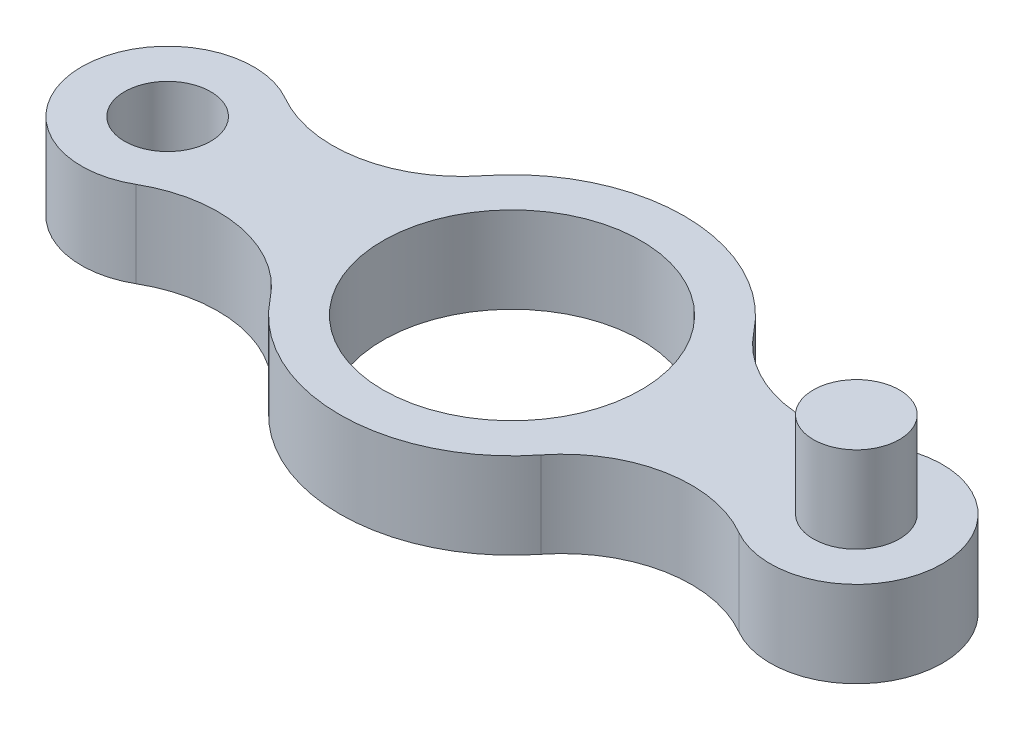
ISO-10303-21;
HEADER;
FILE_DESCRIPTION(('STEP AP214'),'2;1');
FILE_NAME('part.step','',(''),(''),'','','');
FILE_SCHEMA(('AUTOMOTIVE_DESIGN { 1 0 10303 214 1 1 1 1 }'));
ENDSEC;
DATA;
#1=APPLICATION_CONTEXT('core data for automotive mechanical design processes');
#2=APPLICATION_PROTOCOL_DEFINITION('international standard','automotive_design',2000,#1);
#3=PRODUCT_CONTEXT('',#1,'mechanical');
#4=PRODUCT('Part','Part','',(#3));
#5=PRODUCT_RELATED_PRODUCT_CATEGORY('part','',(#4));
#6=PRODUCT_DEFINITION_FORMATION('','',#4);
#7=PRODUCT_DEFINITION_CONTEXT('part definition',#1,'design');
#8=PRODUCT_DEFINITION('design','',#6,#7);
#9=PRODUCT_DEFINITION_SHAPE('','',#8);
#10=(LENGTH_UNIT() NAMED_UNIT(*) SI_UNIT(.MILLI.,.METRE.));
#11=(NAMED_UNIT(*) PLANE_ANGLE_UNIT() SI_UNIT($,.RADIAN.));
#12=(NAMED_UNIT(*) SI_UNIT($,.STERADIAN.) SOLID_ANGLE_UNIT());
#13=UNCERTAINTY_MEASURE_WITH_UNIT(LENGTH_MEASURE(1.E-05),#10,'distance_accuracy_value','');
#14=(GEOMETRIC_REPRESENTATION_CONTEXT(3) GLOBAL_UNCERTAINTY_ASSIGNED_CONTEXT((#13)) GLOBAL_UNIT_ASSIGNED_CONTEXT((#10,
#11,#12)) REPRESENTATION_CONTEXT('',''));
#15=CARTESIAN_POINT('',(0.,0.,0.));
#16=DIRECTION('',(0.,0.,1.));
#17=DIRECTION('',(1.,0.,0.));
#18=AXIS2_PLACEMENT_3D('',#15,#16,#17);
#19=CARTESIAN_POINT('',(55.,20.,-43.3012701892219));
#20=DIRECTION('',(0.,-1.,0.));
#21=DIRECTION('',(0.,0.,-1.));
#22=AXIS2_PLACEMENT_3D('',#19,#20,#21);
#23=CYLINDRICAL_SURFACE('',#22,30.);
#24=CARTESIAN_POINT('',(55.,0.,-43.3012701892219));
#25=DIRECTION('',(0.,-1.,0.));
#26=DIRECTION('',(0.,0.,1.));
#27=AXIS2_PLACEMENT_3D('',#24,#25,#26);
#28=CIRCLE('',#27,30.);
#29=CARTESIAN_POINT('',(70.,0.,-17.3205080756888));
#30=VERTEX_POINT('',#29);
#31=CARTESIAN_POINT('',(31.4285714285714,0.,-24.7435829652697));
#32=VERTEX_POINT('',#31);
#33=EDGE_CURVE('E139',#30,#32,#28,.T.);
#34=ORIENTED_EDGE('',*,*,#33,.T.);
#35=DIRECTION('',(0.,-1.,0.));
#36=VECTOR('',#35,1.);
#37=CARTESIAN_POINT('',(31.4285714285714,20.,-24.7435829652697));
#38=LINE('',#37,#36);
#39=CARTESIAN_POINT('',(31.4285714285714,20.,-24.7435829652697));
#40=VERTEX_POINT('',#39);
#41=EDGE_CURVE('E11',#40,#32,#38,.T.);
#42=ORIENTED_EDGE('',*,*,#41,.F.);
#43=CARTESIAN_POINT('',(55.,20.,-43.3012701892219));
#44=DIRECTION('',(0.,-1.,0.));
#45=DIRECTION('',(0.,0.,1.));
#46=AXIS2_PLACEMENT_3D('',#43,#44,#45);
#47=CIRCLE('',#46,30.);
#48=CARTESIAN_POINT('',(70.,20.,-17.3205080756888));
#49=VERTEX_POINT('',#48);
#50=EDGE_CURVE('E162',#49,#40,#47,.T.);
#51=ORIENTED_EDGE('',*,*,#50,.F.);
#52=DIRECTION('',(0.,-1.,0.));
#53=VECTOR('',#52,1.);
#54=CARTESIAN_POINT('',(70.,20.,-17.3205080756888));
#55=LINE('',#54,#53);
#56=EDGE_CURVE('E135',#49,#30,#55,.T.);
#57=ORIENTED_EDGE('',*,*,#56,.T.);
#58=EDGE_LOOP('',(#34,#42,#51,#57));
#59=FACE_BOUND('',#58,.T.);
#60=ADVANCED_FACE('F38',(#59),#23,.F.);
#61=CARTESIAN_POINT('',(0.,20.,0.));
#62=DIRECTION('',(0.,-1.,0.));
#63=DIRECTION('',(0.,0.,-1.));
#64=AXIS2_PLACEMENT_3D('',#61,#62,#63);
#65=CYLINDRICAL_SURFACE('',#64,40.);
#66=CARTESIAN_POINT('',(0.,0.,0.));
#67=DIRECTION('',(0.,1.,0.));
#68=DIRECTION('',(0.,0.,1.));
#69=AXIS2_PLACEMENT_3D('',#66,#67,#68);
#70=CIRCLE('',#69,40.);
#71=CARTESIAN_POINT('',(-31.4285714285714,0.,-24.7435829652697));
#72=VERTEX_POINT('',#71);
#73=EDGE_CURVE('E143',#32,#72,#70,.T.);
#74=ORIENTED_EDGE('',*,*,#73,.T.);
#75=DIRECTION('',(0.,-1.,0.));
#76=VECTOR('',#75,1.);
#77=CARTESIAN_POINT('',(-31.4285714285714,20.,-24.7435829652697));
#78=LINE('',#77,#76);
#79=CARTESIAN_POINT('',(-31.4285714285714,20.,-24.7435829652697));
#80=VERTEX_POINT('',#79);
#81=EDGE_CURVE('E47',#80,#72,#78,.T.);
#82=ORIENTED_EDGE('',*,*,#81,.F.);
#83=CARTESIAN_POINT('',(0.,20.,0.));
#84=DIRECTION('',(0.,1.,0.));
#85=DIRECTION('',(0.,0.,1.));
#86=AXIS2_PLACEMENT_3D('',#83,#84,#85);
#87=CIRCLE('',#86,40.);
#88=EDGE_CURVE('E98',#40,#80,#87,.T.);
#89=ORIENTED_EDGE('',*,*,#88,.F.);
#90=ORIENTED_EDGE('',*,*,#41,.T.);
#91=EDGE_LOOP('',(#74,#82,#89,#90));
#92=FACE_BOUND('',#91,.T.);
#93=ADVANCED_FACE('F261',(#92),#65,.T.);
#94=CARTESIAN_POINT('',(-55.,20.,-43.3012701892219));
#95=DIRECTION('',(0.,-1.,0.));
#96=DIRECTION('',(0.,0.,-1.));
#97=AXIS2_PLACEMENT_3D('',#94,#95,#96);
#98=CYLINDRICAL_SURFACE('',#97,30.);
#99=CARTESIAN_POINT('',(-55.,0.,-43.3012701892219));
#100=DIRECTION('',(0.,-1.,0.));
#101=DIRECTION('',(0.,0.,-1.));
#102=AXIS2_PLACEMENT_3D('',#99,#100,#101);
#103=CIRCLE('',#102,30.);
#104=CARTESIAN_POINT('',(-70.,0.,-17.3205080756888));
#105=VERTEX_POINT('',#104);
#106=EDGE_CURVE('E147',#72,#105,#103,.T.);
#107=ORIENTED_EDGE('',*,*,#106,.T.);
#108=DIRECTION('',(0.,-1.,0.));
#109=VECTOR('',#108,1.);
#110=CARTESIAN_POINT('',(-70.,20.,-17.3205080756888));
#111=LINE('',#110,#109);
#112=CARTESIAN_POINT('',(-70.,20.,-17.3205080756888));
#113=VERTEX_POINT('',#112);
#114=EDGE_CURVE('E173',#113,#105,#111,.T.);
#115=ORIENTED_EDGE('',*,*,#114,.F.);
#116=CARTESIAN_POINT('',(-55.,20.,-43.3012701892219));
#117=DIRECTION('',(0.,-1.,0.));
#118=DIRECTION('',(0.,0.,-1.));
#119=AXIS2_PLACEMENT_3D('',#116,#117,#118);
#120=CIRCLE('',#119,30.);
#121=EDGE_CURVE('E183',#80,#113,#120,.T.);
#122=ORIENTED_EDGE('',*,*,#121,.F.);
#123=ORIENTED_EDGE('',*,*,#81,.T.);
#124=EDGE_LOOP('',(#107,#115,#122,#123));
#125=FACE_BOUND('',#124,.T.);
#126=ADVANCED_FACE('F181',(#125),#98,.F.);
#127=CARTESIAN_POINT('',(-80.,20.,0.));
#128=DIRECTION('',(0.,-1.,0.));
#129=DIRECTION('',(0.,0.,-1.));
#130=AXIS2_PLACEMENT_3D('',#127,#128,#129);
#131=CYLINDRICAL_SURFACE('',#130,20.);
#132=CARTESIAN_POINT('',(-80.,0.,0.));
#133=DIRECTION('',(0.,1.,0.));
#134=DIRECTION('',(0.,0.,-1.));
#135=AXIS2_PLACEMENT_3D('',#132,#133,#134);
#136=CIRCLE('',#135,20.);
#137=CARTESIAN_POINT('',(-70.,0.,17.3205080756888));
#138=VERTEX_POINT('',#137);
#139=EDGE_CURVE('E150',#105,#138,#136,.T.);
#140=ORIENTED_EDGE('',*,*,#139,.T.);
#141=DIRECTION('',(0.,-1.,0.));
#142=VECTOR('',#141,1.);
#143=CARTESIAN_POINT('',(-70.,20.,17.3205080756888));
#144=LINE('',#143,#142);
#145=CARTESIAN_POINT('',(-70.,20.,17.3205080756888));
#146=VERTEX_POINT('',#145);
#147=EDGE_CURVE('E169',#146,#138,#144,.T.);
#148=ORIENTED_EDGE('',*,*,#147,.F.);
#149=CARTESIAN_POINT('',(-80.,20.,0.));
#150=DIRECTION('',(0.,1.,0.));
#151=DIRECTION('',(0.,0.,-1.));
#152=AXIS2_PLACEMENT_3D('',#149,#150,#151);
#153=CIRCLE('',#152,20.);
#154=EDGE_CURVE('E196',#113,#146,#153,.T.);
#155=ORIENTED_EDGE('',*,*,#154,.F.);
#156=ORIENTED_EDGE('',*,*,#114,.T.);
#157=EDGE_LOOP('',(#140,#148,#155,#156));
#158=FACE_BOUND('',#157,.T.);
#159=ADVANCED_FACE('F191',(#158),#131,.T.);
#160=CARTESIAN_POINT('',(-55.,20.,43.3012701892219));
#161=DIRECTION('',(0.,-1.,0.));
#162=DIRECTION('',(0.,0.,-1.));
#163=AXIS2_PLACEMENT_3D('',#160,#161,#162);
#164=CYLINDRICAL_SURFACE('',#163,30.);
#165=CARTESIAN_POINT('',(-55.,0.,43.3012701892219));
#166=DIRECTION('',(0.,-1.,0.));
#167=DIRECTION('',(0.,0.,1.));
#168=AXIS2_PLACEMENT_3D('',#165,#166,#167);
#169=CIRCLE('',#168,30.);
#170=CARTESIAN_POINT('',(-31.4285714285714,0.,24.7435829652697));
#171=VERTEX_POINT('',#170);
#172=EDGE_CURVE('E153',#138,#171,#169,.T.);
#173=ORIENTED_EDGE('',*,*,#172,.T.);
#174=DIRECTION('',(0.,-1.,0.));
#175=VECTOR('',#174,1.);
#176=CARTESIAN_POINT('',(-31.4285714285714,20.,24.7435829652697));
#177=LINE('',#176,#175);
#178=CARTESIAN_POINT('',(-31.4285714285714,20.,24.7435829652697));
#179=VERTEX_POINT('',#178);
#180=EDGE_CURVE('E128',#179,#171,#177,.T.);
#181=ORIENTED_EDGE('',*,*,#180,.F.);
#182=CARTESIAN_POINT('',(-55.,20.,43.3012701892219));
#183=DIRECTION('',(0.,-1.,0.));
#184=DIRECTION('',(0.,0.,1.));
#185=AXIS2_PLACEMENT_3D('',#182,#183,#184);
#186=CIRCLE('',#185,30.);
#187=EDGE_CURVE('E117',#146,#179,#186,.T.);
#188=ORIENTED_EDGE('',*,*,#187,.F.);
#189=ORIENTED_EDGE('',*,*,#147,.T.);
#190=EDGE_LOOP('',(#173,#181,#188,#189));
#191=FACE_BOUND('',#190,.T.);
#192=ADVANCED_FACE('F194',(#191),#164,.F.);
#193=CARTESIAN_POINT('',(0.,20.,0.));
#194=DIRECTION('',(0.,-1.,0.));
#195=DIRECTION('',(0.,0.,-1.));
#196=AXIS2_PLACEMENT_3D('',#193,#194,#195);
#197=CYLINDRICAL_SURFACE('',#196,40.);
#198=CARTESIAN_POINT('',(0.,0.,0.));
#199=DIRECTION('',(0.,1.,0.));
#200=DIRECTION('',(0.,0.,-1.));
#201=AXIS2_PLACEMENT_3D('',#198,#199,#200);
#202=CIRCLE('',#201,40.);
#203=CARTESIAN_POINT('',(31.4285714285714,0.,24.7435829652697));
#204=VERTEX_POINT('',#203);
#205=EDGE_CURVE('E126',#171,#204,#202,.T.);
#206=ORIENTED_EDGE('',*,*,#205,.T.);
#207=DIRECTION('',(0.,-1.,0.));
#208=VECTOR('',#207,1.);
#209=CARTESIAN_POINT('',(31.4285714285714,20.,24.7435829652697));
#210=LINE('',#209,#208);
#211=CARTESIAN_POINT('',(31.4285714285714,20.,24.7435829652697));
#212=VERTEX_POINT('',#211);
#213=EDGE_CURVE('E123',#212,#204,#210,.T.);
#214=ORIENTED_EDGE('',*,*,#213,.F.);
#215=CARTESIAN_POINT('',(0.,20.,0.));
#216=DIRECTION('',(0.,1.,0.));
#217=DIRECTION('',(0.,0.,-1.));
#218=AXIS2_PLACEMENT_3D('',#215,#216,#217);
#219=CIRCLE('',#218,40.);
#220=EDGE_CURVE('E111',#179,#212,#219,.T.);
#221=ORIENTED_EDGE('',*,*,#220,.F.);
#222=ORIENTED_EDGE('',*,*,#180,.T.);
#223=EDGE_LOOP('',(#206,#214,#221,#222));
#224=FACE_BOUND('',#223,.T.);
#225=ADVANCED_FACE('F124',(#224),#197,.T.);
#226=CARTESIAN_POINT('',(55.,20.,43.3012701892219));
#227=DIRECTION('',(0.,-1.,0.));
#228=DIRECTION('',(0.,0.,-1.));
#229=AXIS2_PLACEMENT_3D('',#226,#227,#228);
#230=CYLINDRICAL_SURFACE('',#229,30.);
#231=CARTESIAN_POINT('',(55.,0.,43.3012701892219));
#232=DIRECTION('',(0.,-1.,0.));
#233=DIRECTION('',(0.,0.,-1.));
#234=AXIS2_PLACEMENT_3D('',#231,#232,#233);
#235=CIRCLE('',#234,30.);
#236=CARTESIAN_POINT('',(70.,0.,17.3205080756888));
#237=VERTEX_POINT('',#236);
#238=EDGE_CURVE('E84',#204,#237,#235,.T.);
#239=ORIENTED_EDGE('',*,*,#238,.T.);
#240=DIRECTION('',(0.,-1.,0.));
#241=VECTOR('',#240,1.);
#242=CARTESIAN_POINT('',(70.,20.,17.3205080756888));
#243=LINE('',#242,#241);
#244=CARTESIAN_POINT('',(70.,20.,17.3205080756888));
#245=VERTEX_POINT('',#244);
#246=EDGE_CURVE('E129',#245,#237,#243,.T.);
#247=ORIENTED_EDGE('',*,*,#246,.F.);
#248=CARTESIAN_POINT('',(55.,20.,43.3012701892219));
#249=DIRECTION('',(0.,-1.,0.));
#250=DIRECTION('',(0.,0.,-1.));
#251=AXIS2_PLACEMENT_3D('',#248,#249,#250);
#252=CIRCLE('',#251,30.);
#253=EDGE_CURVE('E115',#212,#245,#252,.T.);
#254=ORIENTED_EDGE('',*,*,#253,.F.);
#255=ORIENTED_EDGE('',*,*,#213,.T.);
#256=EDGE_LOOP('',(#239,#247,#254,#255));
#257=FACE_BOUND('',#256,.T.);
#258=ADVANCED_FACE('F131',(#257),#230,.F.);
#259=CARTESIAN_POINT('',(80.,20.,0.));
#260=DIRECTION('',(0.,-1.,0.));
#261=DIRECTION('',(0.,0.,-1.));
#262=AXIS2_PLACEMENT_3D('',#259,#260,#261);
#263=CYLINDRICAL_SURFACE('',#262,20.);
#264=CARTESIAN_POINT('',(80.,0.,0.));
#265=DIRECTION('',(0.,1.,0.));
#266=DIRECTION('',(0.,0.,1.));
#267=AXIS2_PLACEMENT_3D('',#264,#265,#266);
#268=CIRCLE('',#267,20.);
#269=EDGE_CURVE('E90',#237,#30,#268,.T.);
#270=ORIENTED_EDGE('',*,*,#269,.T.);
#271=ORIENTED_EDGE('',*,*,#56,.F.);
#272=CARTESIAN_POINT('',(80.,20.,0.));
#273=DIRECTION('',(0.,1.,0.));
#274=DIRECTION('',(0.,0.,1.));
#275=AXIS2_PLACEMENT_3D('',#272,#273,#274);
#276=CIRCLE('',#275,20.);
#277=EDGE_CURVE('E55',#245,#49,#276,.T.);
#278=ORIENTED_EDGE('',*,*,#277,.F.);
#279=ORIENTED_EDGE('',*,*,#246,.T.);
#280=EDGE_LOOP('',(#270,#271,#278,#279));
#281=FACE_BOUND('',#280,.T.);
#282=ADVANCED_FACE('F241',(#281),#263,.T.);
#283=CARTESIAN_POINT('',(67.5,20.,-21.650635094611));
#284=DIRECTION('',(0.,1.,0.));
#285=DIRECTION('',(0.,0.,1.));
#286=AXIS2_PLACEMENT_3D('',#283,#284,#285);
#287=PLANE('',#286);
#288=CARTESIAN_POINT('',(80.,20.,0.));
#289=DIRECTION('',(0.,1.,0.));
#290=DIRECTION('',(0.,0.,1.));
#291=AXIS2_PLACEMENT_3D('',#288,#289,#290);
#292=CIRCLE('',#291,9.99999999999999);
#293=CARTESIAN_POINT('',(80.,20.,10.));
#294=VERTEX_POINT('',#293);
#295=EDGE_CURVE('E222',#294,#294,#292,.T.);
#296=ORIENTED_EDGE('',*,*,#295,.F.);
#297=EDGE_LOOP('',(#296));
#298=FACE_BOUND('',#297,.T.);
#299=CARTESIAN_POINT('',(-80.,20.,0.));
#300=DIRECTION('',(0.,1.,0.));
#301=DIRECTION('',(0.,0.,1.));
#302=AXIS2_PLACEMENT_3D('',#299,#300,#301);
#303=CIRCLE('',#302,9.99999999999999);
#304=CARTESIAN_POINT('',(-80.,20.,10.));
#305=VERTEX_POINT('',#304);
#306=EDGE_CURVE('E214',#305,#305,#303,.T.);
#307=ORIENTED_EDGE('',*,*,#306,.F.);
#308=EDGE_LOOP('',(#307));
#309=FACE_BOUND('',#308,.T.);
#310=CARTESIAN_POINT('',(0.,20.,0.));
#311=DIRECTION('',(0.,1.,0.));
#312=DIRECTION('',(0.,0.,1.));
#313=AXIS2_PLACEMENT_3D('',#310,#311,#312);
#314=CIRCLE('',#313,30.);
#315=CARTESIAN_POINT('',(0.,20.,30.));
#316=VERTEX_POINT('',#315);
#317=EDGE_CURVE('E206',#316,#316,#314,.T.);
#318=ORIENTED_EDGE('',*,*,#317,.F.);
#319=EDGE_LOOP('',(#318));
#320=FACE_BOUND('',#319,.T.);
#321=ORIENTED_EDGE('',*,*,#50,.T.);
#322=ORIENTED_EDGE('',*,*,#88,.T.);
#323=ORIENTED_EDGE('',*,*,#121,.T.);
#324=ORIENTED_EDGE('',*,*,#154,.T.);
#325=ORIENTED_EDGE('',*,*,#187,.T.);
#326=ORIENTED_EDGE('',*,*,#220,.T.);
#327=ORIENTED_EDGE('',*,*,#253,.T.);
#328=ORIENTED_EDGE('',*,*,#277,.T.);
#329=EDGE_LOOP('',(#321,#322,#323,#324,#325,#326,#327,#328));
#330=FACE_BOUND('',#329,.T.);
#331=ADVANCED_FACE('F113',(#298,#309,#320,#330),#287,.T.);
#332=CARTESIAN_POINT('',(67.5,0.,-21.650635094611));
#333=DIRECTION('',(0.,1.,0.));
#334=DIRECTION('',(0.,0.,1.));
#335=AXIS2_PLACEMENT_3D('',#332,#333,#334);
#336=PLANE('',#335);
#337=CARTESIAN_POINT('',(-80.,0.,0.));
#338=DIRECTION('',(0.,1.,0.));
#339=DIRECTION('',(0.,0.,1.));
#340=AXIS2_PLACEMENT_3D('',#337,#338,#339);
#341=CIRCLE('',#340,9.99999999999999);
#342=CARTESIAN_POINT('',(-80.,0.,10.));
#343=VERTEX_POINT('',#342);
#344=EDGE_CURVE('E210',#343,#343,#341,.T.);
#345=ORIENTED_EDGE('',*,*,#344,.T.);
#346=EDGE_LOOP('',(#345));
#347=FACE_BOUND('',#346,.T.);
#348=CARTESIAN_POINT('',(0.,0.,0.));
#349=DIRECTION('',(0.,1.,0.));
#350=DIRECTION('',(0.,0.,1.));
#351=AXIS2_PLACEMENT_3D('',#348,#349,#350);
#352=CIRCLE('',#351,30.);
#353=CARTESIAN_POINT('',(0.,0.,30.));
#354=VERTEX_POINT('',#353);
#355=EDGE_CURVE('E144',#354,#354,#352,.T.);
#356=ORIENTED_EDGE('',*,*,#355,.T.);
#357=EDGE_LOOP('',(#356));
#358=FACE_BOUND('',#357,.T.);
#359=ORIENTED_EDGE('',*,*,#33,.F.);
#360=ORIENTED_EDGE('',*,*,#269,.F.);
#361=ORIENTED_EDGE('',*,*,#238,.F.);
#362=ORIENTED_EDGE('',*,*,#205,.F.);
#363=ORIENTED_EDGE('',*,*,#172,.F.);
#364=ORIENTED_EDGE('',*,*,#139,.F.);
#365=ORIENTED_EDGE('',*,*,#106,.F.);
#366=ORIENTED_EDGE('',*,*,#73,.F.);
#367=EDGE_LOOP('',(#359,#360,#361,#362,#363,#364,#365,#366));
#368=FACE_BOUND('',#367,.T.);
#369=ADVANCED_FACE('F187',(#347,#358,#368),#336,.F.);
#370=CARTESIAN_POINT('',(0.,0.,0.));
#371=DIRECTION('',(0.,1.,0.));
#372=DIRECTION('',(0.,0.,1.));
#373=AXIS2_PLACEMENT_3D('',#370,#371,#372);
#374=CYLINDRICAL_SURFACE('',#373,30.);
#375=ORIENTED_EDGE('',*,*,#355,.F.);
#376=EDGE_LOOP('',(#375));
#377=FACE_BOUND('',#376,.T.);
#378=ORIENTED_EDGE('',*,*,#317,.T.);
#379=EDGE_LOOP('',(#378));
#380=FACE_BOUND('',#379,.T.);
#381=ADVANCED_FACE('F247',(#377,#380),#374,.F.);
#382=CARTESIAN_POINT('',(-80.,0.,0.));
#383=DIRECTION('',(0.,1.,0.));
#384=DIRECTION('',(0.,0.,1.));
#385=AXIS2_PLACEMENT_3D('',#382,#383,#384);
#386=CYLINDRICAL_SURFACE('',#385,9.99999999999999);
#387=ORIENTED_EDGE('',*,*,#344,.F.);
#388=EDGE_LOOP('',(#387));
#389=FACE_BOUND('',#388,.T.);
#390=ORIENTED_EDGE('',*,*,#306,.T.);
#391=EDGE_LOOP('',(#390));
#392=FACE_BOUND('',#391,.T.);
#393=ADVANCED_FACE('F235',(#389,#392),#386,.F.);
#394=CARTESIAN_POINT('',(80.,40.,0.));
#395=DIRECTION('',(0.,-1.,0.));
#396=DIRECTION('',(0.,0.,-1.));
#397=AXIS2_PLACEMENT_3D('',#394,#395,#396);
#398=CYLINDRICAL_SURFACE('',#397,9.99999999999999);
#399=CARTESIAN_POINT('',(80.,40.,0.));
#400=DIRECTION('',(0.,1.,0.));
#401=DIRECTION('',(0.,0.,1.));
#402=AXIS2_PLACEMENT_3D('',#399,#400,#401);
#403=CIRCLE('',#402,9.99999999999999);
#404=CARTESIAN_POINT('',(80.,40.,10.));
#405=VERTEX_POINT('',#404);
#406=EDGE_CURVE('E218',#405,#405,#403,.T.);
#407=ORIENTED_EDGE('',*,*,#406,.F.);
#408=EDGE_LOOP('',(#407));
#409=FACE_BOUND('',#408,.T.);
#410=ORIENTED_EDGE('',*,*,#295,.T.);
#411=EDGE_LOOP('',(#410));
#412=FACE_BOUND('',#411,.T.);
#413=ADVANCED_FACE('F232',(#409,#412),#398,.T.);
#414=CARTESIAN_POINT('',(80.,40.,0.));
#415=DIRECTION('',(0.,1.,0.));
#416=DIRECTION('',(0.,0.,1.));
#417=AXIS2_PLACEMENT_3D('',#414,#415,#416);
#418=PLANE('',#417);
#419=ORIENTED_EDGE('',*,*,#406,.T.);
#420=EDGE_LOOP('',(#419));
#421=FACE_BOUND('',#420,.T.);
#422=ADVANCED_FACE('F230',(#421),#418,.T.);
#423=CLOSED_SHELL('',(#60,#93,#126,#159,#192,#225,#258,#282,#331,#369,#381,#393,#413,#422));
#424=MANIFOLD_SOLID_BREP('B2',#423);
#425=ADVANCED_BREP_SHAPE_REPRESENTATION('',(#18,#424),#14);
#426=SHAPE_DEFINITION_REPRESENTATION(#9,#425);
ENDSEC;
END-ISO-10303-21;
